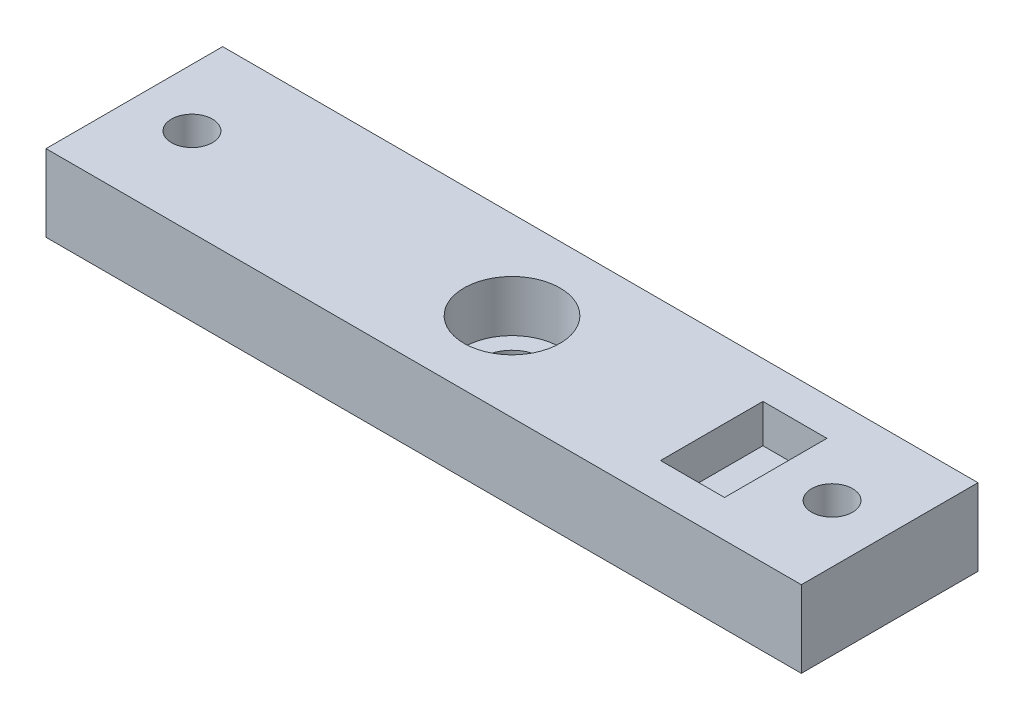
ISO-10303-21;
HEADER;
FILE_DESCRIPTION(('STEP AP214'),'2;1');
FILE_NAME('part.step','',(''),(''),'','','');
FILE_SCHEMA(('AUTOMOTIVE_DESIGN { 1 0 10303 214 1 1 1 1 }'));
ENDSEC;
DATA;
#1=APPLICATION_CONTEXT('core data for automotive mechanical design processes');
#2=APPLICATION_PROTOCOL_DEFINITION('international standard','automotive_design',2000,#1);
#3=PRODUCT_CONTEXT('',#1,'mechanical');
#4=PRODUCT('Part','Part','',(#3));
#5=PRODUCT_RELATED_PRODUCT_CATEGORY('part','',(#4));
#6=PRODUCT_DEFINITION_FORMATION('','',#4);
#7=PRODUCT_DEFINITION_CONTEXT('part definition',#1,'design');
#8=PRODUCT_DEFINITION('design','',#6,#7);
#9=PRODUCT_DEFINITION_SHAPE('','',#8);
#10=(LENGTH_UNIT() NAMED_UNIT(*) SI_UNIT(.MILLI.,.METRE.));
#11=(NAMED_UNIT(*) PLANE_ANGLE_UNIT() SI_UNIT($,.RADIAN.));
#12=(NAMED_UNIT(*) SI_UNIT($,.STERADIAN.) SOLID_ANGLE_UNIT());
#13=UNCERTAINTY_MEASURE_WITH_UNIT(LENGTH_MEASURE(1.E-05),#10,'distance_accuracy_value','');
#14=(GEOMETRIC_REPRESENTATION_CONTEXT(3) GLOBAL_UNCERTAINTY_ASSIGNED_CONTEXT((#13)) GLOBAL_UNIT_ASSIGNED_CONTEXT((#10,
#11,#12)) REPRESENTATION_CONTEXT('',''));
#15=CARTESIAN_POINT('',(0.,0.,0.));
#16=DIRECTION('',(0.,0.,1.));
#17=DIRECTION('',(1.,0.,0.));
#18=AXIS2_PLACEMENT_3D('',#15,#16,#17);
#19=CARTESIAN_POINT('',(0.,0.,-6.9));
#20=DIRECTION('',(0.,1.,0.));
#21=DIRECTION('',(0.,0.,1.));
#22=AXIS2_PLACEMENT_3D('',#19,#20,#21);
#23=CYLINDRICAL_SURFACE('',#22,2.35);
#24=CARTESIAN_POINT('',(0.,2.,-6.9));
#25=DIRECTION('',(0.,1.,0.));
#26=DIRECTION('',(0.,0.,1.));
#27=AXIS2_PLACEMENT_3D('',#24,#25,#26);
#28=CIRCLE('',#27,2.35);
#29=CARTESIAN_POINT('',(0.,2.,-4.55));
#30=VERTEX_POINT('',#29);
#31=EDGE_CURVE('E11',#30,#30,#28,.F.);
#32=ORIENTED_EDGE('',*,*,#31,.F.);
#33=EDGE_LOOP('',(#32));
#34=FACE_BOUND('',#33,.T.);
#35=CARTESIAN_POINT('',(0.,0.,-6.9));
#36=DIRECTION('',(0.,1.,0.));
#37=DIRECTION('',(0.,0.,1.));
#38=AXIS2_PLACEMENT_3D('',#35,#36,#37);
#39=CIRCLE('',#38,2.35);
#40=CARTESIAN_POINT('',(0.,0.,-4.55));
#41=VERTEX_POINT('',#40);
#42=EDGE_CURVE('E108',#41,#41,#39,.T.);
#43=ORIENTED_EDGE('',*,*,#42,.F.);
#44=EDGE_LOOP('',(#43));
#45=FACE_BOUND('',#44,.T.);
#46=ADVANCED_FACE('F35',(#34,#45),#23,.F.);
#47=CARTESIAN_POINT('',(0.,6.,0.));
#48=DIRECTION('',(0.,-1.,0.));
#49=DIRECTION('',(0.,0.,-1.));
#50=AXIS2_PLACEMENT_3D('',#47,#48,#49);
#51=PLANE('',#50);
#52=DIRECTION('',(0.,0.,-1.));
#53=VECTOR('',#52,1.);
#54=CARTESIAN_POINT('',(20.6,6.,0.));
#55=LINE('',#54,#53);
#56=CARTESIAN_POINT('',(20.6,6.,-2.9));
#57=VERTEX_POINT('',#56);
#58=CARTESIAN_POINT('',(20.6,6.,-10.9));
#59=VERTEX_POINT('',#58);
#60=EDGE_CURVE('E152',#57,#59,#55,.T.);
#61=ORIENTED_EDGE('',*,*,#60,.F.);
#62=DIRECTION('',(1.,0.,0.));
#63=VECTOR('',#62,1.);
#64=CARTESIAN_POINT('',(0.,6.,-2.9));
#65=LINE('',#64,#63);
#66=CARTESIAN_POINT('',(15.6,6.,-2.9));
#67=VERTEX_POINT('',#66);
#68=EDGE_CURVE('E50',#67,#57,#65,.T.);
#69=ORIENTED_EDGE('',*,*,#68,.F.);
#70=DIRECTION('',(0.,0.,-1.));
#71=VECTOR('',#70,1.);
#72=CARTESIAN_POINT('',(15.6,6.,0.));
#73=LINE('',#72,#71);
#74=CARTESIAN_POINT('',(15.6,6.,-10.9));
#75=VERTEX_POINT('',#74);
#76=EDGE_CURVE('E145',#67,#75,#73,.T.);
#77=ORIENTED_EDGE('',*,*,#76,.T.);
#78=DIRECTION('',(1.,0.,0.));
#79=VECTOR('',#78,1.);
#80=CARTESIAN_POINT('',(0.,6.,-10.9));
#81=LINE('',#80,#79);
#82=EDGE_CURVE('E149',#75,#59,#81,.T.);
#83=ORIENTED_EDGE('',*,*,#82,.T.);
#84=EDGE_LOOP('',(#61,#69,#77,#83));
#85=FACE_BOUND('',#84,.T.);
#86=CARTESIAN_POINT('',(0.,6.,-6.9));
#87=DIRECTION('',(0.,1.,0.));
#88=DIRECTION('',(0.,0.,1.));
#89=AXIS2_PLACEMENT_3D('',#86,#87,#88);
#90=CIRCLE('',#89,3.75);
#91=CARTESIAN_POINT('',(0.,6.,-3.15));
#92=VERTEX_POINT('',#91);
#93=EDGE_CURVE('E114',#92,#92,#90,.T.);
#94=ORIENTED_EDGE('',*,*,#93,.F.);
#95=EDGE_LOOP('',(#94));
#96=FACE_BOUND('',#95,.T.);
#97=DIRECTION('',(-1.,0.,0.));
#98=VECTOR('',#97,1.);
#99=CARTESIAN_POINT('',(0.,6.,-13.8));
#100=LINE('',#99,#98);
#101=CARTESIAN_POINT('',(29.5,6.,-13.8));
#102=VERTEX_POINT('',#101);
#103=CARTESIAN_POINT('',(-29.5,6.,-13.8));
#104=VERTEX_POINT('',#103);
#105=EDGE_CURVE('E90',#102,#104,#100,.T.);
#106=ORIENTED_EDGE('',*,*,#105,.T.);
#107=DIRECTION('',(0.,0.,-1.));
#108=VECTOR('',#107,1.);
#109=CARTESIAN_POINT('',(-29.5,6.,0.));
#110=LINE('',#109,#108);
#111=CARTESIAN_POINT('',(-29.5,6.,0.));
#112=VERTEX_POINT('',#111);
#113=EDGE_CURVE('E124',#112,#104,#110,.T.);
#114=ORIENTED_EDGE('',*,*,#113,.F.);
#115=DIRECTION('',(1.,0.,0.));
#116=VECTOR('',#115,1.);
#117=CARTESIAN_POINT('',(0.,6.,0.));
#118=LINE('',#117,#116);
#119=CARTESIAN_POINT('',(29.5,6.,0.));
#120=VERTEX_POINT('',#119);
#121=EDGE_CURVE('E97',#112,#120,#118,.T.);
#122=ORIENTED_EDGE('',*,*,#121,.T.);
#123=DIRECTION('',(0.,0.,-1.));
#124=VECTOR('',#123,1.);
#125=CARTESIAN_POINT('',(29.5,6.,0.));
#126=LINE('',#125,#124);
#127=EDGE_CURVE('E59',#120,#102,#126,.T.);
#128=ORIENTED_EDGE('',*,*,#127,.T.);
#129=EDGE_LOOP('',(#106,#114,#122,#128));
#130=FACE_BOUND('',#129,.T.);
#131=CARTESIAN_POINT('',(25.,6.,-6.9));
#132=DIRECTION('',(0.,1.,0.));
#133=DIRECTION('',(0.,0.,1.));
#134=AXIS2_PLACEMENT_3D('',#131,#132,#133);
#135=CIRCLE('',#134,1.6);
#136=CARTESIAN_POINT('',(25.,6.,-5.3));
#137=VERTEX_POINT('',#136);
#138=EDGE_CURVE('E102',#137,#137,#135,.T.);
#139=ORIENTED_EDGE('',*,*,#138,.F.);
#140=EDGE_LOOP('',(#139));
#141=FACE_BOUND('',#140,.T.);
#142=CARTESIAN_POINT('',(-25.,6.,-6.9));
#143=DIRECTION('',(0.,-1.,0.));
#144=DIRECTION('',(0.,0.,1.));
#145=AXIS2_PLACEMENT_3D('',#142,#143,#144);
#146=CIRCLE('',#145,1.6);
#147=CARTESIAN_POINT('',(-25.,6.,-5.3));
#148=VERTEX_POINT('',#147);
#149=EDGE_CURVE('E126',#148,#148,#146,.T.);
#150=ORIENTED_EDGE('',*,*,#149,.T.);
#151=EDGE_LOOP('',(#150));
#152=FACE_BOUND('',#151,.T.);
#153=ADVANCED_FACE('F196',(#85,#96,#130,#141,#152),#51,.F.);
#154=CARTESIAN_POINT('',(0.,0.,0.));
#155=DIRECTION('',(0.,-1.,0.));
#156=DIRECTION('',(0.,0.,-1.));
#157=AXIS2_PLACEMENT_3D('',#154,#155,#156);
#158=PLANE('',#157);
#159=ORIENTED_EDGE('',*,*,#42,.T.);
#160=EDGE_LOOP('',(#159));
#161=FACE_BOUND('',#160,.T.);
#162=DIRECTION('',(0.,0.,-1.));
#163=VECTOR('',#162,1.);
#164=CARTESIAN_POINT('',(-29.5,0.,0.));
#165=LINE('',#164,#163);
#166=CARTESIAN_POINT('',(-29.5,0.,0.));
#167=VERTEX_POINT('',#166);
#168=CARTESIAN_POINT('',(-29.5,0.,-13.8));
#169=VERTEX_POINT('',#168);
#170=EDGE_CURVE('E96',#167,#169,#165,.T.);
#171=ORIENTED_EDGE('',*,*,#170,.T.);
#172=DIRECTION('',(-1.,0.,0.));
#173=VECTOR('',#172,1.);
#174=CARTESIAN_POINT('',(0.,0.,-13.8));
#175=LINE('',#174,#173);
#176=CARTESIAN_POINT('',(29.5,0.,-13.8));
#177=VERTEX_POINT('',#176);
#178=EDGE_CURVE('E81',#177,#169,#175,.T.);
#179=ORIENTED_EDGE('',*,*,#178,.F.);
#180=DIRECTION('',(0.,0.,-1.));
#181=VECTOR('',#180,1.);
#182=CARTESIAN_POINT('',(29.5,0.,0.));
#183=LINE('',#182,#181);
#184=CARTESIAN_POINT('',(29.5,0.,0.));
#185=VERTEX_POINT('',#184);
#186=EDGE_CURVE('E72',#185,#177,#183,.T.);
#187=ORIENTED_EDGE('',*,*,#186,.F.);
#188=DIRECTION('',(1.,0.,0.));
#189=VECTOR('',#188,1.);
#190=CARTESIAN_POINT('',(0.,0.,0.));
#191=LINE('',#190,#189);
#192=EDGE_CURVE('E82',#167,#185,#191,.T.);
#193=ORIENTED_EDGE('',*,*,#192,.F.);
#194=EDGE_LOOP('',(#171,#179,#187,#193));
#195=FACE_BOUND('',#194,.T.);
#196=CARTESIAN_POINT('',(25.,0.,-6.9));
#197=DIRECTION('',(0.,1.,0.));
#198=DIRECTION('',(0.,0.,1.));
#199=AXIS2_PLACEMENT_3D('',#196,#197,#198);
#200=CIRCLE('',#199,1.6);
#201=CARTESIAN_POINT('',(25.,0.,-5.3));
#202=VERTEX_POINT('',#201);
#203=EDGE_CURVE('E105',#202,#202,#200,.T.);
#204=ORIENTED_EDGE('',*,*,#203,.T.);
#205=EDGE_LOOP('',(#204));
#206=FACE_BOUND('',#205,.T.);
#207=CARTESIAN_POINT('',(-25.,0.,-6.9));
#208=DIRECTION('',(0.,-1.,0.));
#209=DIRECTION('',(0.,0.,1.));
#210=AXIS2_PLACEMENT_3D('',#207,#208,#209);
#211=CIRCLE('',#210,1.6);
#212=CARTESIAN_POINT('',(-25.,0.,-5.3));
#213=VERTEX_POINT('',#212);
#214=EDGE_CURVE('E129',#213,#213,#211,.T.);
#215=ORIENTED_EDGE('',*,*,#214,.F.);
#216=EDGE_LOOP('',(#215));
#217=FACE_BOUND('',#216,.T.);
#218=ADVANCED_FACE('F93',(#161,#195,#206,#217),#158,.T.);
#219=CARTESIAN_POINT('',(0.,6.,0.));
#220=DIRECTION('',(0.,0.,-1.));
#221=DIRECTION('',(-1.,0.,0.));
#222=AXIS2_PLACEMENT_3D('',#219,#220,#221);
#223=PLANE('',#222);
#224=ORIENTED_EDGE('',*,*,#192,.T.);
#225=DIRECTION('',(0.,-1.,0.));
#226=VECTOR('',#225,1.);
#227=CARTESIAN_POINT('',(29.5,6.,0.));
#228=LINE('',#227,#226);
#229=EDGE_CURVE('E43',#120,#185,#228,.T.);
#230=ORIENTED_EDGE('',*,*,#229,.F.);
#231=ORIENTED_EDGE('',*,*,#121,.F.);
#232=DIRECTION('',(0.,-1.,0.));
#233=VECTOR('',#232,1.);
#234=CARTESIAN_POINT('',(-29.5,6.,0.));
#235=LINE('',#234,#233);
#236=EDGE_CURVE('E117',#112,#167,#235,.T.);
#237=ORIENTED_EDGE('',*,*,#236,.T.);
#238=EDGE_LOOP('',(#224,#230,#231,#237));
#239=FACE_BOUND('',#238,.T.);
#240=ADVANCED_FACE('F37',(#239),#223,.F.);
#241=CARTESIAN_POINT('',(29.5,6.,0.));
#242=DIRECTION('',(-1.,0.,0.));
#243=DIRECTION('',(0.,0.,1.));
#244=AXIS2_PLACEMENT_3D('',#241,#242,#243);
#245=PLANE('',#244);
#246=ORIENTED_EDGE('',*,*,#186,.T.);
#247=DIRECTION('',(0.,-1.,0.));
#248=VECTOR('',#247,1.);
#249=CARTESIAN_POINT('',(29.5,6.,-13.8));
#250=LINE('',#249,#248);
#251=EDGE_CURVE('E75',#102,#177,#250,.T.);
#252=ORIENTED_EDGE('',*,*,#251,.F.);
#253=ORIENTED_EDGE('',*,*,#127,.F.);
#254=ORIENTED_EDGE('',*,*,#229,.T.);
#255=EDGE_LOOP('',(#246,#252,#253,#254));
#256=FACE_BOUND('',#255,.T.);
#257=ADVANCED_FACE('F74',(#256),#245,.F.);
#258=CARTESIAN_POINT('',(0.,6.,-13.8));
#259=DIRECTION('',(0.,0.,1.));
#260=DIRECTION('',(1.,0.,0.));
#261=AXIS2_PLACEMENT_3D('',#258,#259,#260);
#262=PLANE('',#261);
#263=ORIENTED_EDGE('',*,*,#178,.T.);
#264=DIRECTION('',(0.,-1.,0.));
#265=VECTOR('',#264,1.);
#266=CARTESIAN_POINT('',(-29.5,6.,-13.8));
#267=LINE('',#266,#265);
#268=EDGE_CURVE('E122',#104,#169,#267,.T.);
#269=ORIENTED_EDGE('',*,*,#268,.F.);
#270=ORIENTED_EDGE('',*,*,#105,.F.);
#271=ORIENTED_EDGE('',*,*,#251,.T.);
#272=EDGE_LOOP('',(#263,#269,#270,#271));
#273=FACE_BOUND('',#272,.T.);
#274=ADVANCED_FACE('F86',(#273),#262,.F.);
#275=CARTESIAN_POINT('',(25.,6.,-6.9));
#276=DIRECTION('',(0.,-1.,0.));
#277=DIRECTION('',(0.,0.,-1.));
#278=AXIS2_PLACEMENT_3D('',#275,#276,#277);
#279=CYLINDRICAL_SURFACE('',#278,1.6);
#280=ORIENTED_EDGE('',*,*,#138,.T.);
#281=EDGE_LOOP('',(#280));
#282=FACE_BOUND('',#281,.T.);
#283=ORIENTED_EDGE('',*,*,#203,.F.);
#284=EDGE_LOOP('',(#283));
#285=FACE_BOUND('',#284,.T.);
#286=ADVANCED_FACE('F223',(#282,#285),#279,.F.);
#287=CARTESIAN_POINT('',(0.,2.,-6.9));
#288=DIRECTION('',(0.,1.,0.));
#289=DIRECTION('',(0.,0.,1.));
#290=AXIS2_PLACEMENT_3D('',#287,#288,#289);
#291=CYLINDRICAL_SURFACE('',#290,3.75);
#292=ORIENTED_EDGE('',*,*,#93,.T.);
#293=EDGE_LOOP('',(#292));
#294=FACE_BOUND('',#293,.T.);
#295=CARTESIAN_POINT('',(0.,2.,-6.9));
#296=DIRECTION('',(0.,1.,0.));
#297=DIRECTION('',(0.,0.,1.));
#298=AXIS2_PLACEMENT_3D('',#295,#296,#297);
#299=CIRCLE('',#298,3.75);
#300=CARTESIAN_POINT('',(0.,2.,-3.15));
#301=VERTEX_POINT('',#300);
#302=EDGE_CURVE('E113',#301,#301,#299,.T.);
#303=ORIENTED_EDGE('',*,*,#302,.F.);
#304=EDGE_LOOP('',(#303));
#305=FACE_BOUND('',#304,.T.);
#306=ADVANCED_FACE('F221',(#294,#305),#291,.F.);
#307=CARTESIAN_POINT('',(0.,2.,-6.9));
#308=DIRECTION('',(0.,1.,0.));
#309=DIRECTION('',(0.,0.,1.));
#310=AXIS2_PLACEMENT_3D('',#307,#308,#309);
#311=PLANE('',#310);
#312=ORIENTED_EDGE('',*,*,#31,.T.);
#313=EDGE_LOOP('',(#312));
#314=FACE_BOUND('',#313,.T.);
#315=ORIENTED_EDGE('',*,*,#302,.T.);
#316=EDGE_LOOP('',(#315));
#317=FACE_BOUND('',#316,.T.);
#318=ADVANCED_FACE('F245',(#314,#317),#311,.T.);
#319=CARTESIAN_POINT('',(-29.5,6.,0.));
#320=DIRECTION('',(1.,0.,0.));
#321=DIRECTION('',(0.,0.,1.));
#322=AXIS2_PLACEMENT_3D('',#319,#320,#321);
#323=PLANE('',#322);
#324=ORIENTED_EDGE('',*,*,#170,.F.);
#325=ORIENTED_EDGE('',*,*,#236,.F.);
#326=ORIENTED_EDGE('',*,*,#113,.T.);
#327=ORIENTED_EDGE('',*,*,#268,.T.);
#328=EDGE_LOOP('',(#324,#325,#326,#327));
#329=FACE_BOUND('',#328,.T.);
#330=ADVANCED_FACE('F200',(#329),#323,.F.);
#331=CARTESIAN_POINT('',(-25.,6.,-6.9));
#332=DIRECTION('',(0.,-1.,0.));
#333=DIRECTION('',(0.,0.,-1.));
#334=AXIS2_PLACEMENT_3D('',#331,#332,#333);
#335=CYLINDRICAL_SURFACE('',#334,1.6);
#336=ORIENTED_EDGE('',*,*,#149,.F.);
#337=EDGE_LOOP('',(#336));
#338=FACE_BOUND('',#337,.T.);
#339=ORIENTED_EDGE('',*,*,#214,.T.);
#340=EDGE_LOOP('',(#339));
#341=FACE_BOUND('',#340,.T.);
#342=ADVANCED_FACE('F258',(#338,#341),#335,.F.);
#343=CARTESIAN_POINT('',(0.,3.,-2.9));
#344=DIRECTION('',(0.,0.,1.));
#345=DIRECTION('',(1.,0.,0.));
#346=AXIS2_PLACEMENT_3D('',#343,#344,#345);
#347=PLANE('',#346);
#348=ORIENTED_EDGE('',*,*,#68,.T.);
#349=DIRECTION('',(0.,1.,0.));
#350=VECTOR('',#349,1.);
#351=CARTESIAN_POINT('',(20.6,3.,-2.9));
#352=LINE('',#351,#350);
#353=CARTESIAN_POINT('',(20.6,3.,-2.9));
#354=VERTEX_POINT('',#353);
#355=EDGE_CURVE('E135',#354,#57,#352,.T.);
#356=ORIENTED_EDGE('',*,*,#355,.F.);
#357=DIRECTION('',(1.,0.,0.));
#358=VECTOR('',#357,1.);
#359=CARTESIAN_POINT('',(0.,3.,-2.9));
#360=LINE('',#359,#358);
#361=CARTESIAN_POINT('',(15.6,3.,-2.9));
#362=VERTEX_POINT('',#361);
#363=EDGE_CURVE('E148',#362,#354,#360,.T.);
#364=ORIENTED_EDGE('',*,*,#363,.F.);
#365=DIRECTION('',(0.,1.,0.));
#366=VECTOR('',#365,1.);
#367=CARTESIAN_POINT('',(15.6,3.,-2.9));
#368=LINE('',#367,#366);
#369=EDGE_CURVE('E132',#362,#67,#368,.T.);
#370=ORIENTED_EDGE('',*,*,#369,.T.);
#371=EDGE_LOOP('',(#348,#356,#364,#370));
#372=FACE_BOUND('',#371,.T.);
#373=ADVANCED_FACE('F176',(#372),#347,.F.);
#374=CARTESIAN_POINT('',(15.6,3.,0.));
#375=DIRECTION('',(1.,0.,0.));
#376=DIRECTION('',(0.,0.,-1.));
#377=AXIS2_PLACEMENT_3D('',#374,#375,#376);
#378=PLANE('',#377);
#379=ORIENTED_EDGE('',*,*,#76,.F.);
#380=ORIENTED_EDGE('',*,*,#369,.F.);
#381=DIRECTION('',(0.,0.,-1.));
#382=VECTOR('',#381,1.);
#383=CARTESIAN_POINT('',(15.6,3.,0.));
#384=LINE('',#383,#382);
#385=CARTESIAN_POINT('',(15.6,3.,-10.9));
#386=VERTEX_POINT('',#385);
#387=EDGE_CURVE('E138',#362,#386,#384,.T.);
#388=ORIENTED_EDGE('',*,*,#387,.T.);
#389=DIRECTION('',(0.,1.,0.));
#390=VECTOR('',#389,1.);
#391=CARTESIAN_POINT('',(15.6,3.,-10.9));
#392=LINE('',#391,#390);
#393=EDGE_CURVE('E141',#386,#75,#392,.T.);
#394=ORIENTED_EDGE('',*,*,#393,.T.);
#395=EDGE_LOOP('',(#379,#380,#388,#394));
#396=FACE_BOUND('',#395,.T.);
#397=ADVANCED_FACE('F273',(#396),#378,.T.);
#398=CARTESIAN_POINT('',(0.,3.,-10.9));
#399=DIRECTION('',(0.,0.,1.));
#400=DIRECTION('',(1.,0.,0.));
#401=AXIS2_PLACEMENT_3D('',#398,#399,#400);
#402=PLANE('',#401);
#403=ORIENTED_EDGE('',*,*,#82,.F.);
#404=ORIENTED_EDGE('',*,*,#393,.F.);
#405=DIRECTION('',(1.,0.,0.));
#406=VECTOR('',#405,1.);
#407=CARTESIAN_POINT('',(0.,3.,-10.9));
#408=LINE('',#407,#406);
#409=CARTESIAN_POINT('',(20.6,3.,-10.9));
#410=VERTEX_POINT('',#409);
#411=EDGE_CURVE('E158',#386,#410,#408,.T.);
#412=ORIENTED_EDGE('',*,*,#411,.T.);
#413=DIRECTION('',(0.,1.,0.));
#414=VECTOR('',#413,1.);
#415=CARTESIAN_POINT('',(20.6,3.,-10.9));
#416=LINE('',#415,#414);
#417=EDGE_CURVE('E137',#410,#59,#416,.T.);
#418=ORIENTED_EDGE('',*,*,#417,.T.);
#419=EDGE_LOOP('',(#403,#404,#412,#418));
#420=FACE_BOUND('',#419,.T.);
#421=ADVANCED_FACE('F280',(#420),#402,.T.);
#422=CARTESIAN_POINT('',(20.6,3.,0.));
#423=DIRECTION('',(1.,0.,0.));
#424=DIRECTION('',(0.,0.,-1.));
#425=AXIS2_PLACEMENT_3D('',#422,#423,#424);
#426=PLANE('',#425);
#427=ORIENTED_EDGE('',*,*,#60,.T.);
#428=ORIENTED_EDGE('',*,*,#417,.F.);
#429=DIRECTION('',(0.,0.,-1.));
#430=VECTOR('',#429,1.);
#431=CARTESIAN_POINT('',(20.6,3.,0.));
#432=LINE('',#431,#430);
#433=EDGE_CURVE('E161',#354,#410,#432,.T.);
#434=ORIENTED_EDGE('',*,*,#433,.F.);
#435=ORIENTED_EDGE('',*,*,#355,.T.);
#436=EDGE_LOOP('',(#427,#428,#434,#435));
#437=FACE_BOUND('',#436,.T.);
#438=ADVANCED_FACE('F287',(#437),#426,.F.);
#439=CARTESIAN_POINT('',(0.,3.,0.));
#440=DIRECTION('',(0.,1.,0.));
#441=DIRECTION('',(0.,0.,1.));
#442=AXIS2_PLACEMENT_3D('',#439,#440,#441);
#443=PLANE('',#442);
#444=ORIENTED_EDGE('',*,*,#363,.T.);
#445=ORIENTED_EDGE('',*,*,#433,.T.);
#446=ORIENTED_EDGE('',*,*,#411,.F.);
#447=ORIENTED_EDGE('',*,*,#387,.F.);
#448=EDGE_LOOP('',(#444,#445,#446,#447));
#449=FACE_BOUND('',#448,.T.);
#450=ADVANCED_FACE('F169',(#449),#443,.T.);
#451=CLOSED_SHELL('',(#46,#153,#218,#240,#257,#274,#286,#306,#318,#330,#342,#373,#397,#421,#438,#450));
#452=MANIFOLD_SOLID_BREP('B2',#451);
#453=ADVANCED_BREP_SHAPE_REPRESENTATION('',(#18,#452),#14);
#454=SHAPE_DEFINITION_REPRESENTATION(#9,#453);
ENDSEC;
END-ISO-10303-21;
